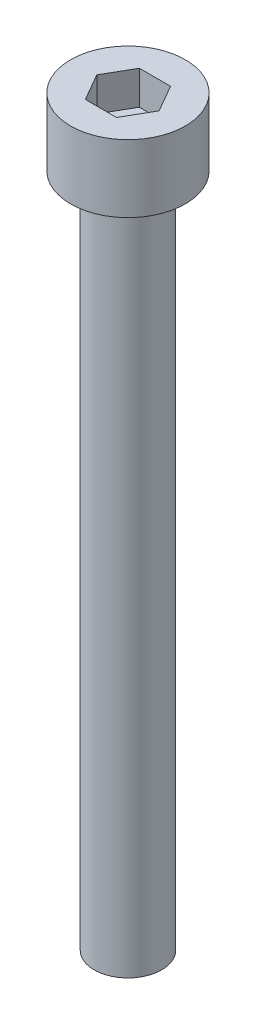
ISO-10303-21;
HEADER;
FILE_DESCRIPTION(('STEP AP214'),'2;1');
FILE_NAME('part.step','',(''),(''),'','','');
FILE_SCHEMA(('AUTOMOTIVE_DESIGN { 1 0 10303 214 1 1 1 1 }'));
ENDSEC;
DATA;
#1=APPLICATION_CONTEXT('core data for automotive mechanical design processes');
#2=APPLICATION_PROTOCOL_DEFINITION('international standard','automotive_design',2000,#1);
#3=PRODUCT_CONTEXT('',#1,'mechanical');
#4=PRODUCT('Part','Part','',(#3));
#5=PRODUCT_RELATED_PRODUCT_CATEGORY('part','',(#4));
#6=PRODUCT_DEFINITION_FORMATION('','',#4);
#7=PRODUCT_DEFINITION_CONTEXT('part definition',#1,'design');
#8=PRODUCT_DEFINITION('design','',#6,#7);
#9=PRODUCT_DEFINITION_SHAPE('','',#8);
#10=(LENGTH_UNIT() NAMED_UNIT(*) SI_UNIT(.MILLI.,.METRE.));
#11=(NAMED_UNIT(*) PLANE_ANGLE_UNIT() SI_UNIT($,.RADIAN.));
#12=(NAMED_UNIT(*) SI_UNIT($,.STERADIAN.) SOLID_ANGLE_UNIT());
#13=UNCERTAINTY_MEASURE_WITH_UNIT(LENGTH_MEASURE(1.E-05),#10,'distance_accuracy_value','');
#14=(GEOMETRIC_REPRESENTATION_CONTEXT(3) GLOBAL_UNCERTAINTY_ASSIGNED_CONTEXT((#13)) GLOBAL_UNIT_ASSIGNED_CONTEXT((#10,
#11,#12)) REPRESENTATION_CONTEXT('',''));
#15=CARTESIAN_POINT('',(0.,0.,0.));
#16=DIRECTION('',(0.,0.,1.));
#17=DIRECTION('',(1.,0.,0.));
#18=AXIS2_PLACEMENT_3D('',#15,#16,#17);
#19=CARTESIAN_POINT('',(0.,5.,0.));
#20=DIRECTION('',(0.,-1.,0.));
#21=DIRECTION('',(0.,0.,-1.));
#22=AXIS2_PLACEMENT_3D('',#19,#20,#21);
#23=CYLINDRICAL_SURFACE('',#22,4.25);
#24=CARTESIAN_POINT('',(0.,5.,0.));
#25=DIRECTION('',(0.,1.,0.));
#26=DIRECTION('',(0.,0.,1.));
#27=AXIS2_PLACEMENT_3D('',#24,#25,#26);
#28=CIRCLE('',#27,4.25);
#29=CARTESIAN_POINT('',(0.,5.,4.25));
#30=VERTEX_POINT('',#29);
#31=EDGE_CURVE('E43',#30,#30,#28,.T.);
#32=ORIENTED_EDGE('',*,*,#31,.F.);
#33=EDGE_LOOP('',(#32));
#34=FACE_BOUND('',#33,.T.);
#35=CARTESIAN_POINT('',(0.,0.,0.));
#36=DIRECTION('',(0.,1.,0.));
#37=DIRECTION('',(0.,0.,1.));
#38=AXIS2_PLACEMENT_3D('',#35,#36,#37);
#39=CIRCLE('',#38,4.25);
#40=CARTESIAN_POINT('',(0.,0.,4.25));
#41=VERTEX_POINT('',#40);
#42=EDGE_CURVE('E38',#41,#41,#39,.T.);
#43=ORIENTED_EDGE('',*,*,#42,.T.);
#44=EDGE_LOOP('',(#43));
#45=FACE_BOUND('',#44,.T.);
#46=ADVANCED_FACE('F35',(#34,#45),#23,.T.);
#47=CARTESIAN_POINT('',(0.,5.,0.));
#48=DIRECTION('',(0.,1.,0.));
#49=DIRECTION('',(0.,0.,1.));
#50=AXIS2_PLACEMENT_3D('',#47,#48,#49);
#51=PLANE('',#50);
#52=DIRECTION('',(0.5,0.,-0.866025403784439));
#53=VECTOR('',#52,1.);
#54=CARTESIAN_POINT('',(1.15470053837925,5.,2.));
#55=LINE('',#54,#53);
#56=CARTESIAN_POINT('',(1.15470053837925,5.,2.));
#57=VERTEX_POINT('',#56);
#58=CARTESIAN_POINT('',(2.3094010767585,5.,0.));
#59=VERTEX_POINT('',#58);
#60=EDGE_CURVE('E51',#57,#59,#55,.T.);
#61=ORIENTED_EDGE('',*,*,#60,.F.);
#62=DIRECTION('',(1.,0.,0.));
#63=VECTOR('',#62,1.);
#64=CARTESIAN_POINT('',(-1.15470053837925,5.,2.));
#65=LINE('',#64,#63);
#66=CARTESIAN_POINT('',(-1.15470053837925,5.,2.));
#67=VERTEX_POINT('',#66);
#68=EDGE_CURVE('E135',#67,#57,#65,.T.);
#69=ORIENTED_EDGE('',*,*,#68,.F.);
#70=DIRECTION('',(0.5,0.,0.866025403784438));
#71=VECTOR('',#70,1.);
#72=CARTESIAN_POINT('',(-2.3094010767585,5.,0.));
#73=LINE('',#72,#71);
#74=CARTESIAN_POINT('',(-2.3094010767585,5.,0.));
#75=VERTEX_POINT('',#74);
#76=EDGE_CURVE('E133',#75,#67,#73,.T.);
#77=ORIENTED_EDGE('',*,*,#76,.F.);
#78=DIRECTION('',(-0.5,0.,0.866025403784439));
#79=VECTOR('',#78,1.);
#80=CARTESIAN_POINT('',(-1.15470053837925,5.,-2.));
#81=LINE('',#80,#79);
#82=CARTESIAN_POINT('',(-1.15470053837925,5.,-2.));
#83=VERTEX_POINT('',#82);
#84=EDGE_CURVE('E99',#83,#75,#81,.T.);
#85=ORIENTED_EDGE('',*,*,#84,.F.);
#86=DIRECTION('',(-1.,0.,0.));
#87=VECTOR('',#86,1.);
#88=CARTESIAN_POINT('',(1.15470053837925,5.,-2.));
#89=LINE('',#88,#87);
#90=CARTESIAN_POINT('',(1.15470053837925,5.,-2.));
#91=VERTEX_POINT('',#90);
#92=EDGE_CURVE('E129',#91,#83,#89,.T.);
#93=ORIENTED_EDGE('',*,*,#92,.F.);
#94=DIRECTION('',(-0.5,0.,-0.866025403784438));
#95=VECTOR('',#94,1.);
#96=CARTESIAN_POINT('',(2.3094010767585,5.,0.));
#97=LINE('',#96,#95);
#98=EDGE_CURVE('E125',#59,#91,#97,.T.);
#99=ORIENTED_EDGE('',*,*,#98,.F.);
#100=EDGE_LOOP('',(#61,#69,#77,#85,#93,#99));
#101=FACE_BOUND('',#100,.T.);
#102=ORIENTED_EDGE('',*,*,#31,.T.);
#103=EDGE_LOOP('',(#102));
#104=FACE_BOUND('',#103,.T.);
#105=ADVANCED_FACE('F153',(#101,#104),#51,.T.);
#106=CARTESIAN_POINT('',(0.,0.,0.));
#107=DIRECTION('',(0.,1.,0.));
#108=DIRECTION('',(0.,0.,1.));
#109=AXIS2_PLACEMENT_3D('',#106,#107,#108);
#110=PLANE('',#109);
#111=CARTESIAN_POINT('',(0.,0.,0.));
#112=DIRECTION('',(0.,-1.,0.));
#113=DIRECTION('',(0.,0.,-1.));
#114=AXIS2_PLACEMENT_3D('',#111,#112,#113);
#115=CIRCLE('',#114,2.5);
#116=CARTESIAN_POINT('',(0.,0.,-2.5));
#117=VERTEX_POINT('',#116);
#118=EDGE_CURVE('E11',#117,#117,#115,.T.);
#119=ORIENTED_EDGE('',*,*,#118,.F.);
#120=EDGE_LOOP('',(#119));
#121=FACE_BOUND('',#120,.T.);
#122=ORIENTED_EDGE('',*,*,#42,.F.);
#123=EDGE_LOOP('',(#122));
#124=FACE_BOUND('',#123,.T.);
#125=ADVANCED_FACE('F150',(#121,#124),#110,.F.);
#126=CARTESIAN_POINT('',(1.15470053837925,2.5,2.));
#127=DIRECTION('',(0.866025403784439,0.,0.5));
#128=DIRECTION('',(0.5,0.,-0.866025403784439));
#129=AXIS2_PLACEMENT_3D('',#126,#127,#128);
#130=PLANE('',#129);
#131=ORIENTED_EDGE('',*,*,#60,.T.);
#132=DIRECTION('',(0.,1.,0.));
#133=VECTOR('',#132,1.);
#134=CARTESIAN_POINT('',(2.3094010767585,2.5,0.));
#135=LINE('',#134,#133);
#136=CARTESIAN_POINT('',(2.3094010767585,2.5,0.));
#137=VERTEX_POINT('',#136);
#138=EDGE_CURVE('E81',#137,#59,#135,.T.);
#139=ORIENTED_EDGE('',*,*,#138,.F.);
#140=DIRECTION('',(0.5,0.,-0.866025403784439));
#141=VECTOR('',#140,1.);
#142=CARTESIAN_POINT('',(1.15470053837925,2.5,2.));
#143=LINE('',#142,#141);
#144=CARTESIAN_POINT('',(1.15470053837925,2.5,2.));
#145=VERTEX_POINT('',#144);
#146=EDGE_CURVE('E137',#145,#137,#143,.T.);
#147=ORIENTED_EDGE('',*,*,#146,.F.);
#148=DIRECTION('',(0.,1.,0.));
#149=VECTOR('',#148,1.);
#150=CARTESIAN_POINT('',(1.15470053837925,2.5,2.));
#151=LINE('',#150,#149);
#152=EDGE_CURVE('E59',#145,#57,#151,.T.);
#153=ORIENTED_EDGE('',*,*,#152,.T.);
#154=EDGE_LOOP('',(#131,#139,#147,#153));
#155=FACE_BOUND('',#154,.T.);
#156=ADVANCED_FACE('F152',(#155),#130,.F.);
#157=CARTESIAN_POINT('',(-1.15470053837925,2.5,2.));
#158=DIRECTION('',(0.,0.,1.));
#159=DIRECTION('',(1.,0.,0.));
#160=AXIS2_PLACEMENT_3D('',#157,#158,#159);
#161=PLANE('',#160);
#162=ORIENTED_EDGE('',*,*,#68,.T.);
#163=ORIENTED_EDGE('',*,*,#152,.F.);
#164=DIRECTION('',(1.,0.,0.));
#165=VECTOR('',#164,1.);
#166=CARTESIAN_POINT('',(-1.15470053837925,2.5,2.));
#167=LINE('',#166,#165);
#168=CARTESIAN_POINT('',(-1.15470053837925,2.5,2.));
#169=VERTEX_POINT('',#168);
#170=EDGE_CURVE('E111',#169,#145,#167,.T.);
#171=ORIENTED_EDGE('',*,*,#170,.F.);
#172=DIRECTION('',(0.,1.,0.));
#173=VECTOR('',#172,1.);
#174=CARTESIAN_POINT('',(-1.15470053837925,2.5,2.));
#175=LINE('',#174,#173);
#176=EDGE_CURVE('E103',#169,#67,#175,.T.);
#177=ORIENTED_EDGE('',*,*,#176,.T.);
#178=EDGE_LOOP('',(#162,#163,#171,#177));
#179=FACE_BOUND('',#178,.T.);
#180=ADVANCED_FACE('F159',(#179),#161,.F.);
#181=CARTESIAN_POINT('',(-2.3094010767585,2.5,0.));
#182=DIRECTION('',(-0.866025403784439,0.,0.5));
#183=DIRECTION('',(0.5,0.,0.866025403784439));
#184=AXIS2_PLACEMENT_3D('',#181,#182,#183);
#185=PLANE('',#184);
#186=ORIENTED_EDGE('',*,*,#76,.T.);
#187=ORIENTED_EDGE('',*,*,#176,.F.);
#188=DIRECTION('',(0.5,0.,0.866025403784438));
#189=VECTOR('',#188,1.);
#190=CARTESIAN_POINT('',(-2.3094010767585,2.5,0.));
#191=LINE('',#190,#189);
#192=CARTESIAN_POINT('',(-2.3094010767585,2.5,0.));
#193=VERTEX_POINT('',#192);
#194=EDGE_CURVE('E107',#193,#169,#191,.T.);
#195=ORIENTED_EDGE('',*,*,#194,.F.);
#196=DIRECTION('',(0.,1.,0.));
#197=VECTOR('',#196,1.);
#198=CARTESIAN_POINT('',(-2.3094010767585,2.5,0.));
#199=LINE('',#198,#197);
#200=EDGE_CURVE('E92',#193,#75,#199,.T.);
#201=ORIENTED_EDGE('',*,*,#200,.T.);
#202=EDGE_LOOP('',(#186,#187,#195,#201));
#203=FACE_BOUND('',#202,.T.);
#204=ADVANCED_FACE('F108',(#203),#185,.F.);
#205=CARTESIAN_POINT('',(-1.15470053837925,2.5,-2.));
#206=DIRECTION('',(-0.866025403784439,0.,-0.5));
#207=DIRECTION('',(-0.5,0.,0.866025403784439));
#208=AXIS2_PLACEMENT_3D('',#205,#206,#207);
#209=PLANE('',#208);
#210=ORIENTED_EDGE('',*,*,#84,.T.);
#211=ORIENTED_EDGE('',*,*,#200,.F.);
#212=DIRECTION('',(-0.5,0.,0.866025403784439));
#213=VECTOR('',#212,1.);
#214=CARTESIAN_POINT('',(-1.15470053837925,2.5,-2.));
#215=LINE('',#214,#213);
#216=CARTESIAN_POINT('',(-1.15470053837925,2.5,-2.));
#217=VERTEX_POINT('',#216);
#218=EDGE_CURVE('E96',#217,#193,#215,.T.);
#219=ORIENTED_EDGE('',*,*,#218,.F.);
#220=DIRECTION('',(0.,1.,0.));
#221=VECTOR('',#220,1.);
#222=CARTESIAN_POINT('',(-1.15470053837925,2.5,-2.));
#223=LINE('',#222,#221);
#224=EDGE_CURVE('E104',#217,#83,#223,.T.);
#225=ORIENTED_EDGE('',*,*,#224,.T.);
#226=EDGE_LOOP('',(#210,#211,#219,#225));
#227=FACE_BOUND('',#226,.T.);
#228=ADVANCED_FACE('F94',(#227),#209,.F.);
#229=CARTESIAN_POINT('',(1.15470053837925,2.5,-2.));
#230=DIRECTION('',(0.,0.,-1.));
#231=DIRECTION('',(-1.,0.,0.));
#232=AXIS2_PLACEMENT_3D('',#229,#230,#231);
#233=PLANE('',#232);
#234=ORIENTED_EDGE('',*,*,#92,.T.);
#235=ORIENTED_EDGE('',*,*,#224,.F.);
#236=DIRECTION('',(-1.,0.,0.));
#237=VECTOR('',#236,1.);
#238=CARTESIAN_POINT('',(1.15470053837925,2.5,-2.));
#239=LINE('',#238,#237);
#240=CARTESIAN_POINT('',(1.15470053837925,2.5,-2.));
#241=VERTEX_POINT('',#240);
#242=EDGE_CURVE('E117',#241,#217,#239,.T.);
#243=ORIENTED_EDGE('',*,*,#242,.F.);
#244=DIRECTION('',(0.,1.,0.));
#245=VECTOR('',#244,1.);
#246=CARTESIAN_POINT('',(1.15470053837925,2.5,-2.));
#247=LINE('',#246,#245);
#248=EDGE_CURVE('E141',#241,#91,#247,.T.);
#249=ORIENTED_EDGE('',*,*,#248,.T.);
#250=EDGE_LOOP('',(#234,#235,#243,#249));
#251=FACE_BOUND('',#250,.T.);
#252=ADVANCED_FACE('F204',(#251),#233,.F.);
#253=CARTESIAN_POINT('',(2.3094010767585,2.5,0.));
#254=DIRECTION('',(0.866025403784438,0.,-0.5));
#255=DIRECTION('',(-0.5,0.,-0.866025403784439));
#256=AXIS2_PLACEMENT_3D('',#253,#254,#255);
#257=PLANE('',#256);
#258=ORIENTED_EDGE('',*,*,#98,.T.);
#259=ORIENTED_EDGE('',*,*,#248,.F.);
#260=DIRECTION('',(-0.5,0.,-0.866025403784438));
#261=VECTOR('',#260,1.);
#262=CARTESIAN_POINT('',(2.3094010767585,2.5,0.));
#263=LINE('',#262,#261);
#264=EDGE_CURVE('E119',#137,#241,#263,.T.);
#265=ORIENTED_EDGE('',*,*,#264,.F.);
#266=ORIENTED_EDGE('',*,*,#138,.T.);
#267=EDGE_LOOP('',(#258,#259,#265,#266));
#268=FACE_BOUND('',#267,.T.);
#269=ADVANCED_FACE('F213',(#268),#257,.F.);
#270=CARTESIAN_POINT('',(0.,2.5,0.));
#271=DIRECTION('',(0.,1.,0.));
#272=DIRECTION('',(0.,0.,1.));
#273=AXIS2_PLACEMENT_3D('',#270,#271,#272);
#274=PLANE('',#273);
#275=ORIENTED_EDGE('',*,*,#146,.T.);
#276=ORIENTED_EDGE('',*,*,#264,.T.);
#277=ORIENTED_EDGE('',*,*,#242,.T.);
#278=ORIENTED_EDGE('',*,*,#218,.T.);
#279=ORIENTED_EDGE('',*,*,#194,.T.);
#280=ORIENTED_EDGE('',*,*,#170,.T.);
#281=EDGE_LOOP('',(#275,#276,#277,#278,#279,#280));
#282=FACE_BOUND('',#281,.T.);
#283=ADVANCED_FACE('F114',(#282),#274,.T.);
#284=CARTESIAN_POINT('',(0.,-50.,0.));
#285=DIRECTION('',(0.,1.,0.));
#286=DIRECTION('',(0.,0.,1.));
#287=AXIS2_PLACEMENT_3D('',#284,#285,#286);
#288=CYLINDRICAL_SURFACE('',#287,2.5);
#289=CARTESIAN_POINT('',(0.,-50.,0.));
#290=DIRECTION('',(0.,-1.,0.));
#291=DIRECTION('',(0.,0.,-1.));
#292=AXIS2_PLACEMENT_3D('',#289,#290,#291);
#293=CIRCLE('',#292,2.5);
#294=CARTESIAN_POINT('',(0.,-50.,-2.5));
#295=VERTEX_POINT('',#294);
#296=EDGE_CURVE('E126',#295,#295,#293,.T.);
#297=ORIENTED_EDGE('',*,*,#296,.F.);
#298=EDGE_LOOP('',(#297));
#299=FACE_BOUND('',#298,.T.);
#300=ORIENTED_EDGE('',*,*,#118,.T.);
#301=EDGE_LOOP('',(#300));
#302=FACE_BOUND('',#301,.T.);
#303=ADVANCED_FACE('F231',(#299,#302),#288,.T.);
#304=CARTESIAN_POINT('',(0.,-50.,0.));
#305=DIRECTION('',(0.,-1.,0.));
#306=DIRECTION('',(0.,0.,-1.));
#307=AXIS2_PLACEMENT_3D('',#304,#305,#306);
#308=PLANE('',#307);
#309=ORIENTED_EDGE('',*,*,#296,.T.);
#310=EDGE_LOOP('',(#309));
#311=FACE_BOUND('',#310,.T.);
#312=ADVANCED_FACE('F244',(#311),#308,.T.);
#313=CLOSED_SHELL('',(#46,#105,#125,#156,#180,#204,#228,#252,#269,#283,#303,#312));
#314=MANIFOLD_SOLID_BREP('B2',#313);
#315=ADVANCED_BREP_SHAPE_REPRESENTATION('',(#18,#314),#14);
#316=SHAPE_DEFINITION_REPRESENTATION(#9,#315);
ENDSEC;
END-ISO-10303-21;
